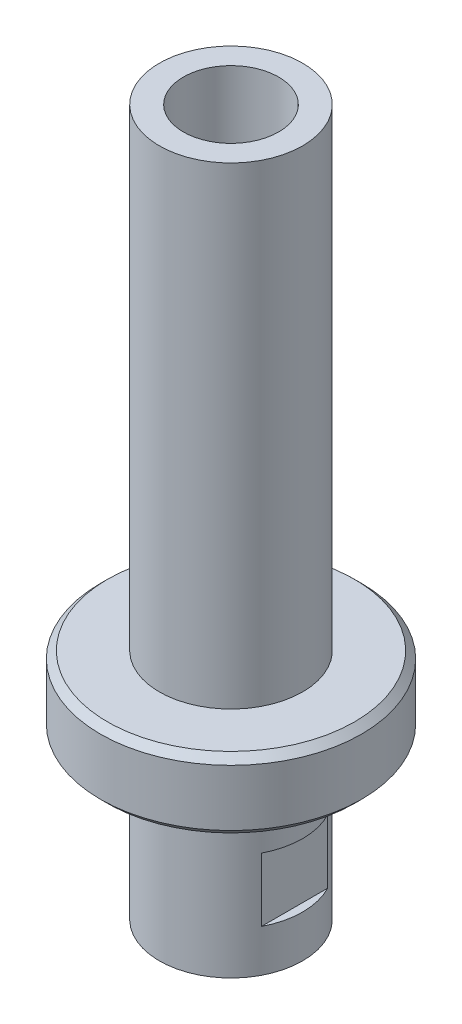
ISO-10303-21;
HEADER;
FILE_DESCRIPTION(('STEP AP214'),'2;1');
FILE_NAME('part.step','',(''),(''),'','','');
FILE_SCHEMA(('AUTOMOTIVE_DESIGN { 1 0 10303 214 1 1 1 1 }'));
ENDSEC;
DATA;
#1=APPLICATION_CONTEXT('core data for automotive mechanical design processes');
#2=APPLICATION_PROTOCOL_DEFINITION('international standard','automotive_design',2000,#1);
#3=PRODUCT_CONTEXT('',#1,'mechanical');
#4=PRODUCT('Part','Part','',(#3));
#5=PRODUCT_RELATED_PRODUCT_CATEGORY('part','',(#4));
#6=PRODUCT_DEFINITION_FORMATION('','',#4);
#7=PRODUCT_DEFINITION_CONTEXT('part definition',#1,'design');
#8=PRODUCT_DEFINITION('design','',#6,#7);
#9=PRODUCT_DEFINITION_SHAPE('','',#8);
#10=(LENGTH_UNIT() NAMED_UNIT(*) SI_UNIT(.MILLI.,.METRE.));
#11=(NAMED_UNIT(*) PLANE_ANGLE_UNIT() SI_UNIT($,.RADIAN.));
#12=(NAMED_UNIT(*) SI_UNIT($,.STERADIAN.) SOLID_ANGLE_UNIT());
#13=UNCERTAINTY_MEASURE_WITH_UNIT(LENGTH_MEASURE(1.E-05),#10,'distance_accuracy_value','');
#14=(GEOMETRIC_REPRESENTATION_CONTEXT(3) GLOBAL_UNCERTAINTY_ASSIGNED_CONTEXT((#13)) GLOBAL_UNIT_ASSIGNED_CONTEXT((#10,
#11,#12)) REPRESENTATION_CONTEXT('',''));
#15=CARTESIAN_POINT('',(0.,0.,0.));
#16=DIRECTION('',(0.,0.,1.));
#17=DIRECTION('',(1.,0.,0.));
#18=AXIS2_PLACEMENT_3D('',#15,#16,#17);
#19=CARTESIAN_POINT('',(6.74999999999999,100.,0.));
#20=DIRECTION('',(0.,1.,0.));
#21=DIRECTION('',(-1.,0.,0.));
#22=AXIS2_PLACEMENT_3D('',#19,#20,#21);
#23=PLANE('',#22);
#24=CARTESIAN_POINT('',(-3.43024899888577E-13,100.,0.));
#25=DIRECTION('',(0.,-1.,0.));
#26=DIRECTION('',(1.,0.,0.));
#27=AXIS2_PLACEMENT_3D('',#24,#25,#26);
#28=CIRCLE('',#27,6.75000000000034);
#29=CARTESIAN_POINT('',(6.74999999999999,100.,0.));
#30=VERTEX_POINT('',#29);
#31=EDGE_CURVE('E202',#30,#30,#28,.T.);
#32=ORIENTED_EDGE('',*,*,#31,.T.);
#33=EDGE_LOOP('',(#32));
#34=FACE_BOUND('',#33,.T.);
#35=CARTESIAN_POINT('',(-3.43024899888577E-13,100.,0.));
#36=DIRECTION('',(0.,-1.,0.));
#37=DIRECTION('',(1.,0.,0.));
#38=AXIS2_PLACEMENT_3D('',#35,#36,#37);
#39=CIRCLE('',#38,10.1500000000003);
#40=CARTESIAN_POINT('',(10.15,100.,0.));
#41=VERTEX_POINT('',#40);
#42=EDGE_CURVE('E80',#41,#41,#39,.T.);
#43=ORIENTED_EDGE('',*,*,#42,.F.);
#44=EDGE_LOOP('',(#43));
#45=FACE_BOUND('',#44,.T.);
#46=ADVANCED_FACE('F34',(#34,#45),#23,.T.);
#47=CARTESIAN_POINT('',(2.49723674611755E-12,-728.004511313528,0.));
#48=DIRECTION('',(0.,-1.,0.));
#49=DIRECTION('',(1.,0.,0.));
#50=AXIS2_PLACEMENT_3D('',#47,#48,#49);
#51=CYLINDRICAL_SURFACE('',#50,10.1500000000002);
#52=ORIENTED_EDGE('',*,*,#42,.T.);
#53=EDGE_LOOP('',(#52));
#54=FACE_BOUND('',#53,.T.);
#55=CARTESIAN_POINT('',(-1.13198216963231E-13,33.,0.));
#56=DIRECTION('',(0.,-1.,0.));
#57=DIRECTION('',(1.,0.,0.));
#58=AXIS2_PLACEMENT_3D('',#55,#56,#57);
#59=CIRCLE('',#58,10.1500000000001);
#60=CARTESIAN_POINT('',(10.15,33.0000000000001,0.));
#61=VERTEX_POINT('',#60);
#62=EDGE_CURVE('E130',#61,#61,#59,.T.);
#63=ORIENTED_EDGE('',*,*,#62,.F.);
#64=EDGE_LOOP('',(#63));
#65=FACE_BOUND('',#64,.T.);
#66=ADVANCED_FACE('F142',(#54,#65),#51,.T.);
#67=CARTESIAN_POINT('',(18.5,33.,0.));
#68=DIRECTION('',(0.,1.,0.));
#69=DIRECTION('',(-1.,0.,0.));
#70=AXIS2_PLACEMENT_3D('',#67,#68,#69);
#71=PLANE('',#70);
#72=CARTESIAN_POINT('',(-1.1319821696323E-13,33.,0.));
#73=DIRECTION('',(0.,1.,0.));
#74=DIRECTION('',(-1.,0.,0.));
#75=AXIS2_PLACEMENT_3D('',#72,#73,#74);
#76=CIRCLE('',#75,17.5);
#77=CARTESIAN_POINT('',(-17.5000000000001,32.9999999999999,0.));
#78=VERTEX_POINT('',#77);
#79=EDGE_CURVE('E11',#78,#78,#76,.T.);
#80=ORIENTED_EDGE('',*,*,#79,.T.);
#81=EDGE_LOOP('',(#80));
#82=FACE_BOUND('',#81,.T.);
#83=ORIENTED_EDGE('',*,*,#62,.T.);
#84=EDGE_LOOP('',(#83));
#85=FACE_BOUND('',#84,.T.);
#86=ADVANCED_FACE('F151',(#82,#85),#71,.T.);
#87=CARTESIAN_POINT('',(2.49723674611755E-12,-728.004511313528,0.));
#88=DIRECTION('',(0.,-1.,0.));
#89=DIRECTION('',(1.,0.,0.));
#90=AXIS2_PLACEMENT_3D('',#87,#88,#89);
#91=CYLINDRICAL_SURFACE('',#90,18.5000000000001);
#92=CARTESIAN_POINT('',(0.,24.,0.));
#93=DIRECTION('',(0.,-1.,0.));
#94=DIRECTION('',(1.,0.,0.));
#95=AXIS2_PLACEMENT_3D('',#92,#93,#94);
#96=CIRCLE('',#95,18.5000000000001);
#97=CARTESIAN_POINT('',(18.5,24.0000000000001,0.));
#98=VERTEX_POINT('',#97);
#99=EDGE_CURVE('E43',#98,#98,#96,.F.);
#100=ORIENTED_EDGE('',*,*,#99,.T.);
#101=EDGE_LOOP('',(#100));
#102=FACE_BOUND('',#101,.T.);
#103=CARTESIAN_POINT('',(-1.09767967964344E-13,31.9999999999999,0.));
#104=DIRECTION('',(0.,1.,0.));
#105=DIRECTION('',(-1.,0.,0.));
#106=AXIS2_PLACEMENT_3D('',#103,#104,#105);
#107=CIRCLE('',#106,18.5000000000001);
#108=CARTESIAN_POINT('',(-18.5000000000002,31.9999999999999,0.));
#109=VERTEX_POINT('',#108);
#110=EDGE_CURVE('E109',#109,#109,#107,.F.);
#111=ORIENTED_EDGE('',*,*,#110,.T.);
#112=EDGE_LOOP('',(#111));
#113=FACE_BOUND('',#112,.T.);
#114=ADVANCED_FACE('F114',(#102,#113),#91,.T.);
#115=CARTESIAN_POINT('',(10.15,23.,0.));
#116=DIRECTION('',(0.,-1.,0.));
#117=DIRECTION('',(1.,0.,0.));
#118=AXIS2_PLACEMENT_3D('',#115,#116,#117);
#119=PLANE('',#118);
#120=CARTESIAN_POINT('',(0.,23.,0.));
#121=DIRECTION('',(0.,-1.,0.));
#122=DIRECTION('',(1.,0.,0.));
#123=AXIS2_PLACEMENT_3D('',#120,#121,#122);
#124=CIRCLE('',#123,17.5);
#125=CARTESIAN_POINT('',(17.4999999999999,23.,0.));
#126=VERTEX_POINT('',#125);
#127=EDGE_CURVE('E106',#126,#126,#124,.T.);
#128=ORIENTED_EDGE('',*,*,#127,.T.);
#129=EDGE_LOOP('',(#128));
#130=FACE_BOUND('',#129,.T.);
#131=CARTESIAN_POINT('',(0.,23.,0.));
#132=DIRECTION('',(0.,-1.,0.));
#133=DIRECTION('',(1.,0.,0.));
#134=AXIS2_PLACEMENT_3D('',#131,#132,#133);
#135=CIRCLE('',#134,10.1500000000001);
#136=CARTESIAN_POINT('',(10.15,23.0000000000001,0.));
#137=VERTEX_POINT('',#136);
#138=EDGE_CURVE('E129',#137,#137,#135,.T.);
#139=ORIENTED_EDGE('',*,*,#138,.F.);
#140=EDGE_LOOP('',(#139));
#141=FACE_BOUND('',#140,.T.);
#142=ADVANCED_FACE('F123',(#130,#141),#119,.T.);
#143=CARTESIAN_POINT('',(2.49723674611755E-12,-728.004511313528,0.));
#144=DIRECTION('',(0.,-1.,0.));
#145=DIRECTION('',(1.,0.,0.));
#146=AXIS2_PLACEMENT_3D('',#143,#144,#145);
#147=CYLINDRICAL_SURFACE('',#146,10.1499999999988);
#148=CARTESIAN_POINT('',(0.,6.00000000000001,0.));
#149=DIRECTION('',(0.,-1.,0.));
#150=DIRECTION('',(0.,0.,-1.));
#151=AXIS2_PLACEMENT_3D('',#148,#149,#150);
#152=CIRCLE('',#151,10.1499999999988);
#153=CARTESIAN_POINT('',(9.,5.99999999999997,4.69281365494304));
#154=VERTEX_POINT('',#153);
#155=CARTESIAN_POINT('',(9.,5.99999999999997,-4.69281365494305));
#156=VERTEX_POINT('',#155);
#157=EDGE_CURVE('E104',#154,#156,#152,.F.);
#158=ORIENTED_EDGE('',*,*,#157,.F.);
#159=DIRECTION('',(0.,-1.,0.));
#160=VECTOR('',#159,1.);
#161=CARTESIAN_POINT('',(9.,-728.004511313528,4.69281365494305));
#162=LINE('',#161,#160);
#163=CARTESIAN_POINT('',(9.,15.,4.69281365493815));
#164=VERTEX_POINT('',#163);
#165=EDGE_CURVE('E100',#164,#154,#162,.T.);
#166=ORIENTED_EDGE('',*,*,#165,.F.);
#167=CARTESIAN_POINT('',(0.,15.,0.));
#168=DIRECTION('',(0.,1.,0.));
#169=DIRECTION('',(0.,0.,1.));
#170=AXIS2_PLACEMENT_3D('',#167,#168,#169);
#171=CIRCLE('',#170,10.1499999999988);
#172=CARTESIAN_POINT('',(9.,15.,-4.69281365493815));
#173=VERTEX_POINT('',#172);
#174=EDGE_CURVE('E98',#173,#164,#171,.F.);
#175=ORIENTED_EDGE('',*,*,#174,.F.);
#176=DIRECTION('',(0.,-1.,0.));
#177=VECTOR('',#176,1.);
#178=CARTESIAN_POINT('',(9.,-728.004511313528,-4.69281365494305));
#179=LINE('',#178,#177);
#180=EDGE_CURVE('E102',#156,#173,#179,.F.);
#181=ORIENTED_EDGE('',*,*,#180,.F.);
#182=EDGE_LOOP('',(#158,#166,#175,#181));
#183=FACE_BOUND('',#182,.T.);
#184=CARTESIAN_POINT('',(0.,6.00000000000001,0.));
#185=DIRECTION('',(0.,-1.,0.));
#186=DIRECTION('',(0.,0.,-1.));
#187=AXIS2_PLACEMENT_3D('',#184,#185,#186);
#188=CIRCLE('',#187,10.1499999999988);
#189=CARTESIAN_POINT('',(-9.00000000000004,6.00000000000001,-4.69281365493821));
#190=VERTEX_POINT('',#189);
#191=CARTESIAN_POINT('',(-9.00000000000004,6.00000000000001,4.69281365493821));
#192=VERTEX_POINT('',#191);
#193=EDGE_CURVE('E92',#190,#192,#188,.F.);
#194=ORIENTED_EDGE('',*,*,#193,.F.);
#195=DIRECTION('',(0.,-1.,0.));
#196=VECTOR('',#195,1.);
#197=CARTESIAN_POINT('',(-8.99999999999494,-728.004511313528,-4.69281365494315));
#198=LINE('',#197,#196);
#199=CARTESIAN_POINT('',(-9.0000000000001,15.,-4.69281365493815));
#200=VERTEX_POINT('',#199);
#201=EDGE_CURVE('E79',#200,#190,#198,.T.);
#202=ORIENTED_EDGE('',*,*,#201,.F.);
#203=CARTESIAN_POINT('',(0.,15.,0.));
#204=DIRECTION('',(0.,1.,0.));
#205=DIRECTION('',(0.,0.,1.));
#206=AXIS2_PLACEMENT_3D('',#203,#204,#205);
#207=CIRCLE('',#206,10.1499999999988);
#208=CARTESIAN_POINT('',(-9.0000000000001,15.,4.69281365493815));
#209=VERTEX_POINT('',#208);
#210=EDGE_CURVE('E74',#209,#200,#207,.F.);
#211=ORIENTED_EDGE('',*,*,#210,.F.);
#212=DIRECTION('',(0.,-1.,0.));
#213=VECTOR('',#212,1.);
#214=CARTESIAN_POINT('',(-8.99999999999494,-728.004511313528,4.69281365494315));
#215=LINE('',#214,#213);
#216=EDGE_CURVE('E86',#192,#209,#215,.F.);
#217=ORIENTED_EDGE('',*,*,#216,.F.);
#218=EDGE_LOOP('',(#194,#202,#211,#217));
#219=FACE_BOUND('',#218,.T.);
#220=ORIENTED_EDGE('',*,*,#138,.T.);
#221=EDGE_LOOP('',(#220));
#222=FACE_BOUND('',#221,.T.);
#223=CARTESIAN_POINT('',(0.,0.,0.));
#224=DIRECTION('',(0.,-1.,0.));
#225=DIRECTION('',(1.,0.,0.));
#226=AXIS2_PLACEMENT_3D('',#223,#224,#225);
#227=CIRCLE('',#226,10.1499999999974);
#228=CARTESIAN_POINT('',(10.1499999999974,0.,0.));
#229=VERTEX_POINT('',#228);
#230=EDGE_CURVE('E131',#229,#229,#227,.T.);
#231=ORIENTED_EDGE('',*,*,#230,.F.);
#232=EDGE_LOOP('',(#231));
#233=FACE_BOUND('',#232,.T.);
#234=ADVANCED_FACE('F90',(#183,#219,#222,#233),#147,.T.);
#235=CARTESIAN_POINT('',(6.75000000000001,0.,0.));
#236=DIRECTION('',(0.,-1.,0.));
#237=DIRECTION('',(1.,0.,0.));
#238=AXIS2_PLACEMENT_3D('',#235,#236,#237);
#239=PLANE('',#238);
#240=ORIENTED_EDGE('',*,*,#230,.T.);
#241=EDGE_LOOP('',(#240));
#242=FACE_BOUND('',#241,.T.);
#243=CARTESIAN_POINT('',(0.,0.,0.));
#244=DIRECTION('',(0.,-1.,0.));
#245=DIRECTION('',(1.,0.,0.));
#246=AXIS2_PLACEMENT_3D('',#243,#244,#245);
#247=CIRCLE('',#246,6.75000000000001);
#248=CARTESIAN_POINT('',(6.75000000000001,0.,0.));
#249=VERTEX_POINT('',#248);
#250=EDGE_CURVE('E136',#249,#249,#247,.T.);
#251=ORIENTED_EDGE('',*,*,#250,.F.);
#252=EDGE_LOOP('',(#251));
#253=FACE_BOUND('',#252,.T.);
#254=ADVANCED_FACE('F167',(#242,#253),#239,.T.);
#255=CARTESIAN_POINT('',(2.49723674611755E-12,-728.004511313528,0.));
#256=DIRECTION('',(0.,-1.,0.));
#257=DIRECTION('',(1.,0.,0.));
#258=AXIS2_PLACEMENT_3D('',#255,#256,#257);
#259=CYLINDRICAL_SURFACE('',#258,6.75000000000017);
#260=ORIENTED_EDGE('',*,*,#250,.T.);
#261=EDGE_LOOP('',(#260));
#262=FACE_BOUND('',#261,.T.);
#263=ORIENTED_EDGE('',*,*,#31,.F.);
#264=EDGE_LOOP('',(#263));
#265=FACE_BOUND('',#264,.T.);
#266=ADVANCED_FACE('F171',(#262,#265),#259,.F.);
#267=CARTESIAN_POINT('',(-9.00000000000004,5.99999999999997,-18.5000000000001));
#268=DIRECTION('',(1.,0.,0.));
#269=DIRECTION('',(0.,1.,0.));
#270=AXIS2_PLACEMENT_3D('',#267,#268,#269);
#271=PLANE('',#270);
#272=ORIENTED_EDGE('',*,*,#216,.T.);
#273=DIRECTION('',(0.,0.,1.));
#274=VECTOR('',#273,1.);
#275=CARTESIAN_POINT('',(-9.0000000000001,15.,-18.5000000000001));
#276=LINE('',#275,#274);
#277=EDGE_CURVE('E56',#200,#209,#276,.T.);
#278=ORIENTED_EDGE('',*,*,#277,.F.);
#279=ORIENTED_EDGE('',*,*,#201,.T.);
#280=DIRECTION('',(0.,0.,1.));
#281=VECTOR('',#280,1.);
#282=CARTESIAN_POINT('',(-9.00000000000004,5.99999999999997,-18.5000000000001));
#283=LINE('',#282,#281);
#284=EDGE_CURVE('E87',#190,#192,#283,.T.);
#285=ORIENTED_EDGE('',*,*,#284,.T.);
#286=EDGE_LOOP('',(#272,#278,#279,#285));
#287=FACE_BOUND('',#286,.T.);
#288=ADVANCED_FACE('F83',(#287),#271,.F.);
#289=CARTESIAN_POINT('',(-9.00000000000004,5.99999999999997,-18.5000000000001));
#290=DIRECTION('',(0.,-1.,0.));
#291=DIRECTION('',(0.,0.,-1.));
#292=AXIS2_PLACEMENT_3D('',#289,#290,#291);
#293=PLANE('',#292);
#294=ORIENTED_EDGE('',*,*,#193,.T.);
#295=ORIENTED_EDGE('',*,*,#284,.F.);
#296=EDGE_LOOP('',(#294,#295));
#297=FACE_BOUND('',#296,.T.);
#298=ADVANCED_FACE('F178',(#297),#293,.F.);
#299=CARTESIAN_POINT('',(-9.0000000000001,15.,-18.5000000000001));
#300=DIRECTION('',(0.,1.,0.));
#301=DIRECTION('',(0.,0.,1.));
#302=AXIS2_PLACEMENT_3D('',#299,#300,#301);
#303=PLANE('',#302);
#304=ORIENTED_EDGE('',*,*,#210,.T.);
#305=ORIENTED_EDGE('',*,*,#277,.T.);
#306=EDGE_LOOP('',(#304,#305));
#307=FACE_BOUND('',#306,.T.);
#308=ADVANCED_FACE('F75',(#307),#303,.F.);
#309=CARTESIAN_POINT('',(9.,5.99999999999997,-18.5000000000001));
#310=DIRECTION('',(0.,-1.,0.));
#311=DIRECTION('',(0.,0.,-1.));
#312=AXIS2_PLACEMENT_3D('',#309,#310,#311);
#313=PLANE('',#312);
#314=ORIENTED_EDGE('',*,*,#157,.T.);
#315=DIRECTION('',(0.,0.,1.));
#316=VECTOR('',#315,1.);
#317=CARTESIAN_POINT('',(9.,5.99999999999997,-18.5000000000001));
#318=LINE('',#317,#316);
#319=EDGE_CURVE('E198',#156,#154,#318,.T.);
#320=ORIENTED_EDGE('',*,*,#319,.T.);
#321=EDGE_LOOP('',(#314,#320));
#322=FACE_BOUND('',#321,.T.);
#323=ADVANCED_FACE('F181',(#322),#313,.F.);
#324=CARTESIAN_POINT('',(9.,5.99999999999997,-18.5000000000001));
#325=DIRECTION('',(-1.,0.,0.));
#326=DIRECTION('',(0.,0.,1.));
#327=AXIS2_PLACEMENT_3D('',#324,#325,#326);
#328=PLANE('',#327);
#329=ORIENTED_EDGE('',*,*,#180,.T.);
#330=DIRECTION('',(0.,0.,1.));
#331=VECTOR('',#330,1.);
#332=CARTESIAN_POINT('',(9.,15.,-18.5000000000001));
#333=LINE('',#332,#331);
#334=EDGE_CURVE('E49',#173,#164,#333,.T.);
#335=ORIENTED_EDGE('',*,*,#334,.T.);
#336=ORIENTED_EDGE('',*,*,#165,.T.);
#337=ORIENTED_EDGE('',*,*,#319,.F.);
#338=EDGE_LOOP('',(#329,#335,#336,#337));
#339=FACE_BOUND('',#338,.T.);
#340=ADVANCED_FACE('F187',(#339),#328,.F.);
#341=CARTESIAN_POINT('',(9.,15.,-18.5000000000001));
#342=DIRECTION('',(0.,1.,0.));
#343=DIRECTION('',(0.,0.,1.));
#344=AXIS2_PLACEMENT_3D('',#341,#342,#343);
#345=PLANE('',#344);
#346=ORIENTED_EDGE('',*,*,#174,.T.);
#347=ORIENTED_EDGE('',*,*,#334,.F.);
#348=EDGE_LOOP('',(#346,#347));
#349=FACE_BOUND('',#348,.T.);
#350=ADVANCED_FACE('F120',(#349),#345,.F.);
#351=CARTESIAN_POINT('',(0.,23.,0.));
#352=DIRECTION('',(0.,1.,0.));
#353=DIRECTION('',(-1.,0.,0.));
#354=AXIS2_PLACEMENT_3D('',#351,#352,#353);
#355=CONICAL_SURFACE('',#354,17.5,0.785398163397471);
#356=ORIENTED_EDGE('',*,*,#99,.F.);
#357=EDGE_LOOP('',(#356));
#358=FACE_BOUND('',#357,.T.);
#359=ORIENTED_EDGE('',*,*,#127,.F.);
#360=EDGE_LOOP('',(#359));
#361=FACE_BOUND('',#360,.T.);
#362=ADVANCED_FACE('F117',(#358,#361),#355,.T.);
#363=CARTESIAN_POINT('',(-1.09767967964344E-13,31.9999999999999,0.));
#364=DIRECTION('',(0.,-1.,0.));
#365=DIRECTION('',(1.,0.,0.));
#366=AXIS2_PLACEMENT_3D('',#363,#364,#365);
#367=CONICAL_SURFACE('',#366,18.5000000000001,0.785398163397467);
#368=ORIENTED_EDGE('',*,*,#79,.F.);
#369=EDGE_LOOP('',(#368));
#370=FACE_BOUND('',#369,.T.);
#371=ORIENTED_EDGE('',*,*,#110,.F.);
#372=EDGE_LOOP('',(#371));
#373=FACE_BOUND('',#372,.T.);
#374=ADVANCED_FACE('F37',(#370,#373),#367,.T.);
#375=CLOSED_SHELL('',(#46,#66,#86,#114,#142,#234,#254,#266,#288,#298,#308,#323,#340,#350,#362,#374));
#376=MANIFOLD_SOLID_BREP('B2',#375);
#377=ADVANCED_BREP_SHAPE_REPRESENTATION('',(#18,#376),#14);
#378=SHAPE_DEFINITION_REPRESENTATION(#9,#377);
ENDSEC;
END-ISO-10303-21;
